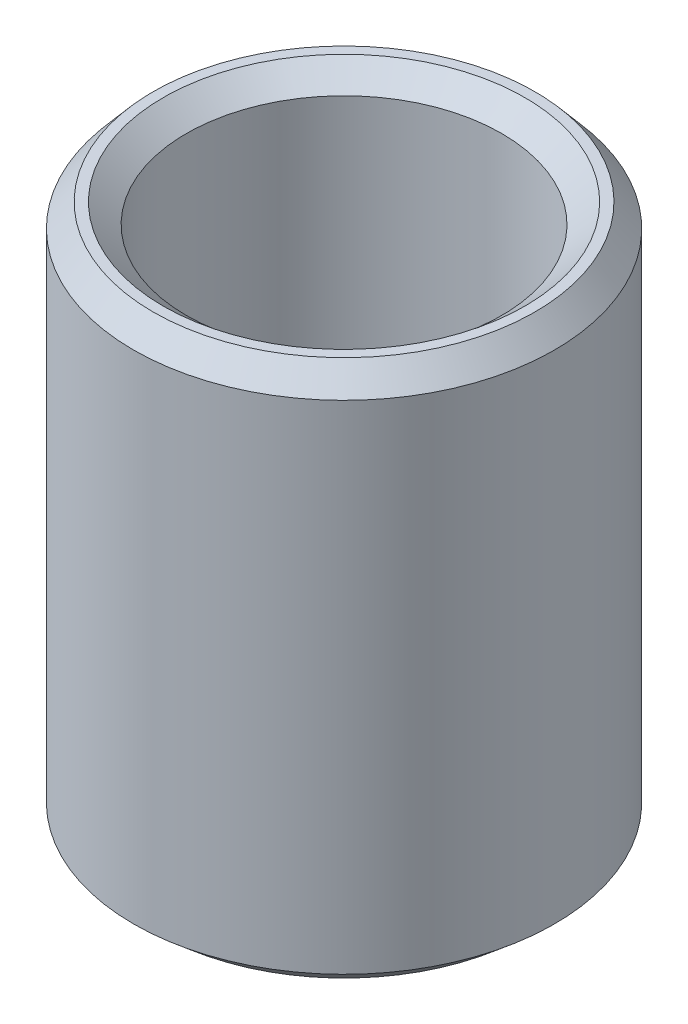
ISO-10303-21;
HEADER;
FILE_DESCRIPTION(('STEP AP214'),'2;1');
FILE_NAME('part.step','',(''),(''),'','','');
FILE_SCHEMA(('AUTOMOTIVE_DESIGN { 1 0 10303 214 1 1 1 1 }'));
ENDSEC;
DATA;
#1=APPLICATION_CONTEXT('core data for automotive mechanical design processes');
#2=APPLICATION_PROTOCOL_DEFINITION('international standard','automotive_design',2000,#1);
#3=PRODUCT_CONTEXT('',#1,'mechanical');
#4=PRODUCT('Part','Part','',(#3));
#5=PRODUCT_RELATED_PRODUCT_CATEGORY('part','',(#4));
#6=PRODUCT_DEFINITION_FORMATION('','',#4);
#7=PRODUCT_DEFINITION_CONTEXT('part definition',#1,'design');
#8=PRODUCT_DEFINITION('design','',#6,#7);
#9=PRODUCT_DEFINITION_SHAPE('','',#8);
#10=(LENGTH_UNIT() NAMED_UNIT(*) SI_UNIT(.MILLI.,.METRE.));
#11=(NAMED_UNIT(*) PLANE_ANGLE_UNIT() SI_UNIT($,.RADIAN.));
#12=(NAMED_UNIT(*) SI_UNIT($,.STERADIAN.) SOLID_ANGLE_UNIT());
#13=UNCERTAINTY_MEASURE_WITH_UNIT(LENGTH_MEASURE(1.E-05),#10,'distance_accuracy_value','');
#14=(GEOMETRIC_REPRESENTATION_CONTEXT(3) GLOBAL_UNCERTAINTY_ASSIGNED_CONTEXT((#13)) GLOBAL_UNIT_ASSIGNED_CONTEXT((#10,
#11,#12)) REPRESENTATION_CONTEXT('',''));
#15=CARTESIAN_POINT('',(0.,0.,0.));
#16=DIRECTION('',(0.,0.,1.));
#17=DIRECTION('',(1.,0.,0.));
#18=AXIS2_PLACEMENT_3D('',#15,#16,#17);
#19=CARTESIAN_POINT('',(0.,25.6444028322103,0.));
#20=DIRECTION('',(0.,-1.,0.));
#21=DIRECTION('',(0.,0.,-1.));
#22=AXIS2_PLACEMENT_3D('',#19,#20,#21);
#23=CYLINDRICAL_SURFACE('',#22,10.);
#24=CARTESIAN_POINT('',(0.,0.931687125417011,0.));
#25=DIRECTION('',(0.,1.,0.));
#26=DIRECTION('',(0.,0.,1.));
#27=AXIS2_PLACEMENT_3D('',#24,#25,#26);
#28=CIRCLE('',#27,10.);
#29=CARTESIAN_POINT('',(0.,0.931687125417011,10.));
#30=VERTEX_POINT('',#29);
#31=EDGE_CURVE('E10',#30,#30,#28,.T.);
#32=ORIENTED_EDGE('',*,*,#31,.T.);
#33=EDGE_LOOP('',(#32));
#34=FACE_BOUND('',#33,.T.);
#35=CARTESIAN_POINT('',(0.,24.5474861480365,0.));
#36=DIRECTION('',(0.,1.,0.));
#37=DIRECTION('',(0.,0.,1.));
#38=AXIS2_PLACEMENT_3D('',#35,#36,#37);
#39=CIRCLE('',#38,10.);
#40=CARTESIAN_POINT('',(0.,24.5474861480365,10.));
#41=VERTEX_POINT('',#40);
#42=EDGE_CURVE('E50',#41,#41,#39,.F.);
#43=ORIENTED_EDGE('',*,*,#42,.T.);
#44=EDGE_LOOP('',(#43));
#45=FACE_BOUND('',#44,.T.);
#46=ADVANCED_FACE('F39',(#34,#45),#23,.T.);
#47=CARTESIAN_POINT('',(0.,25.6444028322103,0.));
#48=DIRECTION('',(0.,1.,0.));
#49=DIRECTION('',(0.,0.,1.));
#50=AXIS2_PLACEMENT_3D('',#47,#48,#49);
#51=PLANE('',#50);
#52=CARTESIAN_POINT('',(0.,25.6444028322103,0.));
#53=DIRECTION('',(0.,1.,0.));
#54=DIRECTION('',(0.,0.,1.));
#55=AXIS2_PLACEMENT_3D('',#52,#53,#54);
#56=CIRCLE('',#55,8.58748673119641);
#57=CARTESIAN_POINT('',(0.,25.6444028322103,8.58748673119641));
#58=VERTEX_POINT('',#57);
#59=EDGE_CURVE('E58',#58,#58,#56,.F.);
#60=ORIENTED_EDGE('',*,*,#59,.T.);
#61=EDGE_LOOP('',(#60));
#62=FACE_BOUND('',#61,.T.);
#63=CARTESIAN_POINT('',(0.,25.6444028322103,0.));
#64=DIRECTION('',(0.,1.,0.));
#65=DIRECTION('',(0.,0.,1.));
#66=AXIS2_PLACEMENT_3D('',#63,#64,#65);
#67=CIRCLE('',#66,9.06831287458298);
#68=CARTESIAN_POINT('',(0.,25.6444028322103,9.06831287458298));
#69=VERTEX_POINT('',#68);
#70=EDGE_CURVE('E61',#69,#69,#67,.T.);
#71=ORIENTED_EDGE('',*,*,#70,.T.);
#72=EDGE_LOOP('',(#71));
#73=FACE_BOUND('',#72,.T.);
#74=ADVANCED_FACE('F88',(#62,#73),#51,.T.);
#75=CARTESIAN_POINT('',(0.,0.,0.));
#76=DIRECTION('',(0.,1.,0.));
#77=DIRECTION('',(0.,0.,1.));
#78=AXIS2_PLACEMENT_3D('',#75,#76,#77);
#79=PLANE('',#78);
#80=CARTESIAN_POINT('',(0.,0.,0.));
#81=DIRECTION('',(0.,1.,0.));
#82=DIRECTION('',(0.,0.,1.));
#83=AXIS2_PLACEMENT_3D('',#80,#81,#82);
#84=CIRCLE('',#83,8.42225717243968);
#85=CARTESIAN_POINT('',(0.,0.,8.42225717243968));
#86=VERTEX_POINT('',#85);
#87=EDGE_CURVE('E51',#86,#86,#84,.T.);
#88=ORIENTED_EDGE('',*,*,#87,.T.);
#89=EDGE_LOOP('',(#88));
#90=FACE_BOUND('',#89,.T.);
#91=CARTESIAN_POINT('',(0.,0.,0.));
#92=DIRECTION('',(0.,1.,0.));
#93=DIRECTION('',(0.,0.,1.));
#94=AXIS2_PLACEMENT_3D('',#91,#92,#93);
#95=CIRCLE('',#94,8.90308331582626);
#96=CARTESIAN_POINT('',(0.,0.,8.90308331582626));
#97=VERTEX_POINT('',#96);
#98=EDGE_CURVE('E54',#97,#97,#95,.F.);
#99=ORIENTED_EDGE('',*,*,#98,.T.);
#100=EDGE_LOOP('',(#99));
#101=FACE_BOUND('',#100,.T.);
#102=ADVANCED_FACE('F83',(#90,#101),#79,.F.);
#103=CARTESIAN_POINT('',(0.,25.6444028322103,0.));
#104=DIRECTION('',(0.,-1.,0.));
#105=DIRECTION('',(0.,0.,-1.));
#106=AXIS2_PLACEMENT_3D('',#103,#104,#105);
#107=CYLINDRICAL_SURFACE('',#106,7.49057004702266);
#108=CARTESIAN_POINT('',(0.,24.7127157067933,0.));
#109=DIRECTION('',(0.,1.,0.));
#110=DIRECTION('',(0.,0.,1.));
#111=AXIS2_PLACEMENT_3D('',#108,#109,#110);
#112=CIRCLE('',#111,7.49057004702266);
#113=CARTESIAN_POINT('',(0.,24.7127157067933,7.49057004702266));
#114=VERTEX_POINT('',#113);
#115=EDGE_CURVE('E67',#114,#114,#112,.T.);
#116=ORIENTED_EDGE('',*,*,#115,.T.);
#117=EDGE_LOOP('',(#116));
#118=FACE_BOUND('',#117,.T.);
#119=CARTESIAN_POINT('',(0.,1.09691668417375,0.));
#120=DIRECTION('',(0.,1.,0.));
#121=DIRECTION('',(0.,0.,1.));
#122=AXIS2_PLACEMENT_3D('',#119,#120,#121);
#123=CIRCLE('',#122,7.49057004702266);
#124=CARTESIAN_POINT('',(0.,1.09691668417375,7.49057004702266));
#125=VERTEX_POINT('',#124);
#126=EDGE_CURVE('E69',#125,#125,#123,.F.);
#127=ORIENTED_EDGE('',*,*,#126,.T.);
#128=EDGE_LOOP('',(#127));
#129=FACE_BOUND('',#128,.T.);
#130=ADVANCED_FACE('F71',(#118,#129),#107,.F.);
#131=CARTESIAN_POINT('',(0.,24.7127157067933,0.));
#132=DIRECTION('',(0.,1.,0.));
#133=DIRECTION('',(0.,0.,1.));
#134=AXIS2_PLACEMENT_3D('',#131,#132,#133);
#135=CONICAL_SURFACE('',#134,7.49057004702266,0.866668652593332);
#136=ORIENTED_EDGE('',*,*,#59,.F.);
#137=EDGE_LOOP('',(#136));
#138=FACE_BOUND('',#137,.T.);
#139=ORIENTED_EDGE('',*,*,#115,.F.);
#140=EDGE_LOOP('',(#139));
#141=FACE_BOUND('',#140,.T.);
#142=ADVANCED_FACE('F77',(#138,#141),#135,.F.);
#143=CARTESIAN_POINT('',(0.,0.,0.));
#144=DIRECTION('',(0.,-1.,0.));
#145=DIRECTION('',(0.,0.,-1.));
#146=AXIS2_PLACEMENT_3D('',#143,#144,#145);
#147=CONICAL_SURFACE('',#146,8.42225717243968,0.704127674201567);
#148=ORIENTED_EDGE('',*,*,#126,.F.);
#149=EDGE_LOOP('',(#148));
#150=FACE_BOUND('',#149,.T.);
#151=ORIENTED_EDGE('',*,*,#87,.F.);
#152=EDGE_LOOP('',(#151));
#153=FACE_BOUND('',#152,.T.);
#154=ADVANCED_FACE('F73',(#150,#153),#147,.F.);
#155=CARTESIAN_POINT('',(0.,0.931687125417011,0.));
#156=DIRECTION('',(0.,1.,0.));
#157=DIRECTION('',(0.,0.,1.));
#158=AXIS2_PLACEMENT_3D('',#155,#156,#157);
#159=CONICAL_SURFACE('',#158,10.,0.866668652593333);
#160=ORIENTED_EDGE('',*,*,#98,.F.);
#161=EDGE_LOOP('',(#160));
#162=FACE_BOUND('',#161,.T.);
#163=ORIENTED_EDGE('',*,*,#31,.F.);
#164=EDGE_LOOP('',(#163));
#165=FACE_BOUND('',#164,.T.);
#166=ADVANCED_FACE('F76',(#162,#165),#159,.T.);
#167=CARTESIAN_POINT('',(0.,25.6444028322103,0.));
#168=DIRECTION('',(0.,-1.,0.));
#169=DIRECTION('',(0.,0.,-1.));
#170=AXIS2_PLACEMENT_3D('',#167,#168,#169);
#171=CONICAL_SURFACE('',#170,9.06831287458298,0.704127674201568);
#172=ORIENTED_EDGE('',*,*,#42,.F.);
#173=EDGE_LOOP('',(#172));
#174=FACE_BOUND('',#173,.T.);
#175=ORIENTED_EDGE('',*,*,#70,.F.);
#176=EDGE_LOOP('',(#175));
#177=FACE_BOUND('',#176,.T.);
#178=ADVANCED_FACE('F45',(#174,#177),#171,.T.);
#179=CLOSED_SHELL('',(#46,#74,#102,#130,#142,#154,#166,#178));
#180=MANIFOLD_SOLID_BREP('B2',#179);
#181=ADVANCED_BREP_SHAPE_REPRESENTATION('',(#18,#180),#14);
#182=SHAPE_DEFINITION_REPRESENTATION(#9,#181);
ENDSEC;
END-ISO-10303-21;
